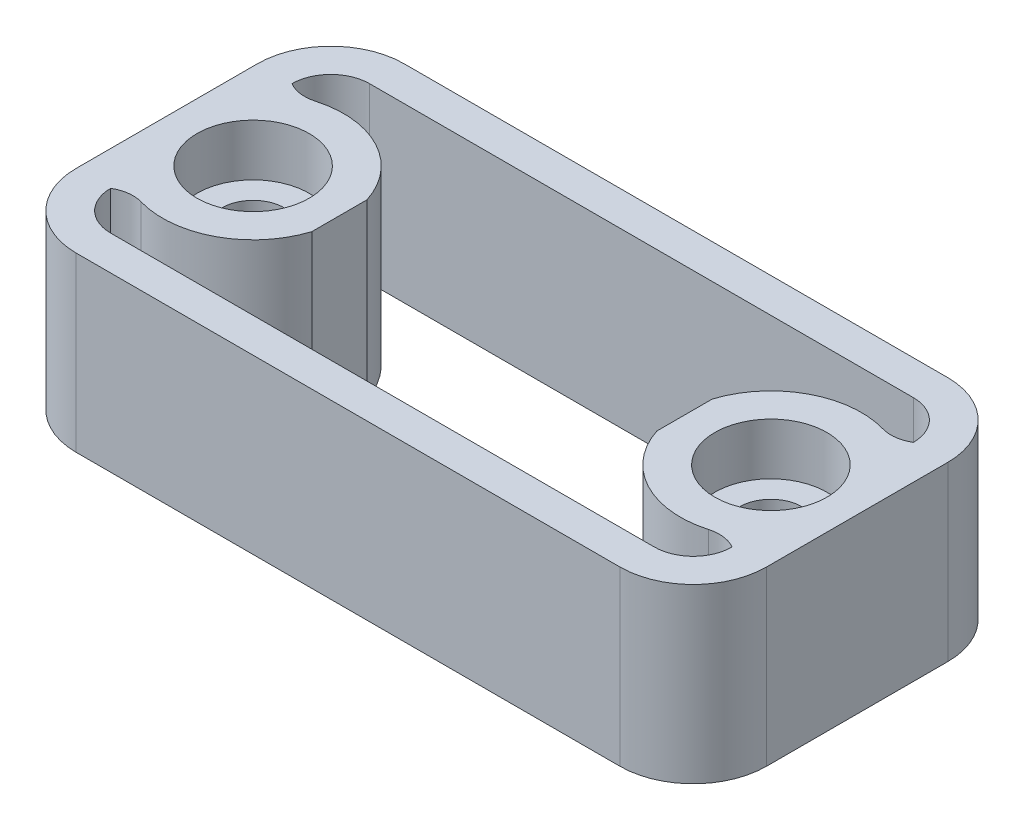
ISO-10303-21;
HEADER;
FILE_DESCRIPTION(('STEP AP214'),'2;1');
FILE_NAME('part.step','',(''),(''),'','','');
FILE_SCHEMA(('AUTOMOTIVE_DESIGN { 1 0 10303 214 1 1 1 1 }'));
ENDSEC;
DATA;
#1=APPLICATION_CONTEXT('core data for automotive mechanical design processes');
#2=APPLICATION_PROTOCOL_DEFINITION('international standard','automotive_design',2000,#1);
#3=PRODUCT_CONTEXT('',#1,'mechanical');
#4=PRODUCT('Part','Part','',(#3));
#5=PRODUCT_RELATED_PRODUCT_CATEGORY('part','',(#4));
#6=PRODUCT_DEFINITION_FORMATION('','',#4);
#7=PRODUCT_DEFINITION_CONTEXT('part definition',#1,'design');
#8=PRODUCT_DEFINITION('design','',#6,#7);
#9=PRODUCT_DEFINITION_SHAPE('','',#8);
#10=(LENGTH_UNIT() NAMED_UNIT(*) SI_UNIT(.MILLI.,.METRE.));
#11=(NAMED_UNIT(*) PLANE_ANGLE_UNIT() SI_UNIT($,.RADIAN.));
#12=(NAMED_UNIT(*) SI_UNIT($,.STERADIAN.) SOLID_ANGLE_UNIT());
#13=UNCERTAINTY_MEASURE_WITH_UNIT(LENGTH_MEASURE(1.E-05),#10,'distance_accuracy_value','');
#14=(GEOMETRIC_REPRESENTATION_CONTEXT(3) GLOBAL_UNCERTAINTY_ASSIGNED_CONTEXT((#13)) GLOBAL_UNIT_ASSIGNED_CONTEXT((#10,
#11,#12)) REPRESENTATION_CONTEXT('',''));
#15=CARTESIAN_POINT('',(0.,0.,0.));
#16=DIRECTION('',(0.,0.,1.));
#17=DIRECTION('',(1.,0.,0.));
#18=AXIS2_PLACEMENT_3D('',#15,#16,#17);
#19=CARTESIAN_POINT('',(-18.,10.,7.50000000000001));
#20=DIRECTION('',(0.,0.,-1.));
#21=DIRECTION('',(-1.,0.,0.));
#22=AXIS2_PLACEMENT_3D('',#19,#20,#21);
#23=PLANE('',#22);
#24=DIRECTION('',(1.,0.,0.));
#25=VECTOR('',#24,1.);
#26=CARTESIAN_POINT('',(-18.,0.,7.50000000000001));
#27=LINE('',#26,#25);
#28=CARTESIAN_POINT('',(-15.75,0.,7.50000000000001));
#29=VERTEX_POINT('',#28);
#30=CARTESIAN_POINT('',(15.75,0.,7.5));
#31=VERTEX_POINT('',#30);
#32=EDGE_CURVE('E258',#29,#31,#27,.T.);
#33=ORIENTED_EDGE('',*,*,#32,.F.);
#34=DIRECTION('',(0.,1.,0.));
#35=VECTOR('',#34,1.);
#36=CARTESIAN_POINT('',(-15.75,0.,7.50000000000001));
#37=LINE('',#36,#35);
#38=CARTESIAN_POINT('',(-15.75,10.,7.50000000000001));
#39=VERTEX_POINT('',#38);
#40=EDGE_CURVE('E209',#29,#39,#37,.T.);
#41=ORIENTED_EDGE('',*,*,#40,.T.);
#42=DIRECTION('',(1.,0.,0.));
#43=VECTOR('',#42,1.);
#44=CARTESIAN_POINT('',(-18.,10.,7.50000000000001));
#45=LINE('',#44,#43);
#46=CARTESIAN_POINT('',(15.75,10.,7.5));
#47=VERTEX_POINT('',#46);
#48=EDGE_CURVE('E259',#39,#47,#45,.T.);
#49=ORIENTED_EDGE('',*,*,#48,.T.);
#50=DIRECTION('',(0.,1.,0.));
#51=VECTOR('',#50,1.);
#52=CARTESIAN_POINT('',(15.75,0.,7.5));
#53=LINE('',#52,#51);
#54=EDGE_CURVE('E215',#31,#47,#53,.T.);
#55=ORIENTED_EDGE('',*,*,#54,.F.);
#56=EDGE_LOOP('',(#33,#41,#49,#55));
#57=FACE_BOUND('',#56,.T.);
#58=ADVANCED_FACE('F33',(#57),#23,.T.);
#59=CARTESIAN_POINT('',(-18.,10.,-7.49999999999999));
#60=DIRECTION('',(0.,0.,1.));
#61=DIRECTION('',(1.,0.,0.));
#62=AXIS2_PLACEMENT_3D('',#59,#60,#61);
#63=PLANE('',#62);
#64=DIRECTION('',(-1.,0.,0.));
#65=VECTOR('',#64,1.);
#66=CARTESIAN_POINT('',(-18.,10.,-7.49999999999999));
#67=LINE('',#66,#65);
#68=CARTESIAN_POINT('',(15.75,10.,-7.49999999999999));
#69=VERTEX_POINT('',#68);
#70=CARTESIAN_POINT('',(-15.75,10.,-7.49999999999999));
#71=VERTEX_POINT('',#70);
#72=EDGE_CURVE('E261',#69,#71,#67,.T.);
#73=ORIENTED_EDGE('',*,*,#72,.T.);
#74=DIRECTION('',(0.,1.,0.));
#75=VECTOR('',#74,1.);
#76=CARTESIAN_POINT('',(-15.75,0.,-7.49999999999999));
#77=LINE('',#76,#75);
#78=CARTESIAN_POINT('',(-15.75,0.,-7.49999999999999));
#79=VERTEX_POINT('',#78);
#80=EDGE_CURVE('E380',#79,#71,#77,.T.);
#81=ORIENTED_EDGE('',*,*,#80,.F.);
#82=DIRECTION('',(-1.,0.,0.));
#83=VECTOR('',#82,1.);
#84=CARTESIAN_POINT('',(-18.,0.,-7.49999999999999));
#85=LINE('',#84,#83);
#86=CARTESIAN_POINT('',(15.75,0.,-7.49999999999999));
#87=VERTEX_POINT('',#86);
#88=EDGE_CURVE('E262',#87,#79,#85,.T.);
#89=ORIENTED_EDGE('',*,*,#88,.F.);
#90=DIRECTION('',(0.,1.,0.));
#91=VECTOR('',#90,1.);
#92=CARTESIAN_POINT('',(15.75,0.,-7.49999999999999));
#93=LINE('',#92,#91);
#94=EDGE_CURVE('E390',#87,#69,#93,.T.);
#95=ORIENTED_EDGE('',*,*,#94,.T.);
#96=EDGE_LOOP('',(#73,#81,#89,#95));
#97=FACE_BOUND('',#96,.T.);
#98=ADVANCED_FACE('F462',(#97),#63,.T.);
#99=CARTESIAN_POINT('',(0.,10.,0.));
#100=DIRECTION('',(0.,1.,0.));
#101=DIRECTION('',(0.,0.,1.));
#102=AXIS2_PLACEMENT_3D('',#99,#100,#101);
#103=PLANE('',#102);
#104=CARTESIAN_POINT('',(-15.,10.,0.));
#105=DIRECTION('',(0.,-1.,0.));
#106=DIRECTION('',(0.,0.,1.));
#107=AXIS2_PLACEMENT_3D('',#104,#105,#106);
#108=CIRCLE('',#107,5.25);
#109=CARTESIAN_POINT('',(-16.4371352785146,10.,-5.04946949602122));
#110=VERTEX_POINT('',#109);
#111=CARTESIAN_POINT('',(-10.,10.,-1.60078105935822));
#112=VERTEX_POINT('',#111);
#113=EDGE_CURVE('E375',#110,#112,#108,.T.);
#114=ORIENTED_EDGE('',*,*,#113,.F.);
#115=CARTESIAN_POINT('',(-16.9846153846154,10.,-6.97307692307692));
#116=DIRECTION('',(0.,1.,0.));
#117=DIRECTION('',(0.,0.,1.));
#118=AXIS2_PLACEMENT_3D('',#115,#116,#117);
#119=CIRCLE('',#118,2.);
#120=CARTESIAN_POINT('',(-18.,10.,-5.24999999999999));
#121=VERTEX_POINT('',#120);
#122=EDGE_CURVE('E355',#110,#121,#119,.F.);
#123=ORIENTED_EDGE('',*,*,#122,.T.);
#124=CARTESIAN_POINT('',(-15.75,10.,-5.24999999999999));
#125=DIRECTION('',(0.,1.,0.));
#126=DIRECTION('',(0.,0.,1.));
#127=AXIS2_PLACEMENT_3D('',#124,#125,#126);
#128=CIRCLE('',#127,2.25);
#129=EDGE_CURVE('E374',#71,#121,#128,.T.);
#130=ORIENTED_EDGE('',*,*,#129,.F.);
#131=ORIENTED_EDGE('',*,*,#72,.F.);
#132=CARTESIAN_POINT('',(15.75,10.,-5.24999999999999));
#133=DIRECTION('',(0.,1.,0.));
#134=DIRECTION('',(0.,0.,1.));
#135=AXIS2_PLACEMENT_3D('',#132,#133,#134);
#136=CIRCLE('',#135,2.25);
#137=CARTESIAN_POINT('',(18.,10.,-5.24999999999999));
#138=VERTEX_POINT('',#137);
#139=EDGE_CURVE('E381',#138,#69,#136,.T.);
#140=ORIENTED_EDGE('',*,*,#139,.F.);
#141=CARTESIAN_POINT('',(16.9846153846154,10.,-6.97307692307692));
#142=DIRECTION('',(0.,1.,0.));
#143=DIRECTION('',(0.,0.,1.));
#144=AXIS2_PLACEMENT_3D('',#141,#142,#143);
#145=CIRCLE('',#144,2.);
#146=CARTESIAN_POINT('',(16.4371352785146,10.,-5.04946949602122));
#147=VERTEX_POINT('',#146);
#148=EDGE_CURVE('E351',#138,#147,#145,.F.);
#149=ORIENTED_EDGE('',*,*,#148,.T.);
#150=CARTESIAN_POINT('',(15.,10.,0.));
#151=DIRECTION('',(0.,-1.,0.));
#152=DIRECTION('',(0.,0.,1.));
#153=AXIS2_PLACEMENT_3D('',#150,#151,#152);
#154=CIRCLE('',#153,5.25);
#155=CARTESIAN_POINT('',(10.,10.,-1.60078105935821));
#156=VERTEX_POINT('',#155);
#157=EDGE_CURVE('E409',#156,#147,#154,.T.);
#158=ORIENTED_EDGE('',*,*,#157,.F.);
#159=DIRECTION('',(0.,0.,1.));
#160=VECTOR('',#159,1.);
#161=CARTESIAN_POINT('',(10.,10.,-7.5));
#162=LINE('',#161,#160);
#163=CARTESIAN_POINT('',(10.,10.,1.60078105935822));
#164=VERTEX_POINT('',#163);
#165=EDGE_CURVE('E255',#156,#164,#162,.T.);
#166=ORIENTED_EDGE('',*,*,#165,.T.);
#167=CARTESIAN_POINT('',(16.4371352785146,10.,5.04946949602122));
#168=VERTEX_POINT('',#167);
#169=EDGE_CURVE('E384',#168,#164,#154,.T.);
#170=ORIENTED_EDGE('',*,*,#169,.F.);
#171=CARTESIAN_POINT('',(16.9846153846154,10.,6.97307692307692));
#172=DIRECTION('',(0.,1.,0.));
#173=DIRECTION('',(0.,0.,1.));
#174=AXIS2_PLACEMENT_3D('',#171,#172,#173);
#175=CIRCLE('',#174,2.);
#176=CARTESIAN_POINT('',(18.,10.,5.25));
#177=VERTEX_POINT('',#176);
#178=EDGE_CURVE('E347',#168,#177,#175,.F.);
#179=ORIENTED_EDGE('',*,*,#178,.T.);
#180=CARTESIAN_POINT('',(15.75,10.,5.25));
#181=DIRECTION('',(0.,1.,0.));
#182=DIRECTION('',(0.,0.,1.));
#183=AXIS2_PLACEMENT_3D('',#180,#181,#182);
#184=CIRCLE('',#183,2.25);
#185=EDGE_CURVE('E405',#47,#177,#184,.T.);
#186=ORIENTED_EDGE('',*,*,#185,.F.);
#187=ORIENTED_EDGE('',*,*,#48,.F.);
#188=CARTESIAN_POINT('',(-15.75,10.,5.25));
#189=DIRECTION('',(0.,1.,0.));
#190=DIRECTION('',(0.,0.,1.));
#191=AXIS2_PLACEMENT_3D('',#188,#189,#190);
#192=CIRCLE('',#191,2.25);
#193=CARTESIAN_POINT('',(-18.,10.,5.25));
#194=VERTEX_POINT('',#193);
#195=EDGE_CURVE('E410',#194,#39,#192,.T.);
#196=ORIENTED_EDGE('',*,*,#195,.F.);
#197=CARTESIAN_POINT('',(-16.9846153846154,10.,6.97307692307692));
#198=DIRECTION('',(0.,1.,0.));
#199=DIRECTION('',(0.,0.,1.));
#200=AXIS2_PLACEMENT_3D('',#197,#198,#199);
#201=CIRCLE('',#200,2.);
#202=CARTESIAN_POINT('',(-16.4371352785146,10.,5.04946949602122));
#203=VERTEX_POINT('',#202);
#204=EDGE_CURVE('E41',#194,#203,#201,.F.);
#205=ORIENTED_EDGE('',*,*,#204,.T.);
#206=CARTESIAN_POINT('',(-10.,10.,1.60078105935822));
#207=VERTEX_POINT('',#206);
#208=EDGE_CURVE('E444',#207,#203,#108,.T.);
#209=ORIENTED_EDGE('',*,*,#208,.F.);
#210=DIRECTION('',(0.,0.,-1.));
#211=VECTOR('',#210,1.);
#212=CARTESIAN_POINT('',(-10.,10.,-7.5));
#213=LINE('',#212,#211);
#214=EDGE_CURVE('E249',#207,#112,#213,.T.);
#215=ORIENTED_EDGE('',*,*,#214,.T.);
#216=EDGE_LOOP('',(#114,#123,#130,#131,#140,#149,#158,#166,#170,#179,#186,#187,#196,#205,#209,#215));
#217=FACE_BOUND('',#216,.T.);
#218=CARTESIAN_POINT('',(-15.,10.,0.));
#219=DIRECTION('',(0.,1.,0.));
#220=DIRECTION('',(0.,0.,1.));
#221=AXIS2_PLACEMENT_3D('',#218,#219,#220);
#222=CIRCLE('',#221,3.25);
#223=CARTESIAN_POINT('',(-15.,10.,3.25));
#224=VERTEX_POINT('',#223);
#225=EDGE_CURVE('E221',#224,#224,#222,.T.);
#226=ORIENTED_EDGE('',*,*,#225,.F.);
#227=EDGE_LOOP('',(#226));
#228=FACE_BOUND('',#227,.T.);
#229=CARTESIAN_POINT('',(15.,10.,0.));
#230=DIRECTION('',(0.,1.,0.));
#231=DIRECTION('',(0.,0.,1.));
#232=AXIS2_PLACEMENT_3D('',#229,#230,#231);
#233=CIRCLE('',#232,3.25);
#234=CARTESIAN_POINT('',(15.,10.,3.25));
#235=VERTEX_POINT('',#234);
#236=EDGE_CURVE('E234',#235,#235,#233,.T.);
#237=ORIENTED_EDGE('',*,*,#236,.F.);
#238=EDGE_LOOP('',(#237));
#239=FACE_BOUND('',#238,.T.);
#240=DIRECTION('',(0.,0.,1.));
#241=VECTOR('',#240,1.);
#242=CARTESIAN_POINT('',(-20.,10.,-9.49999999999999));
#243=LINE('',#242,#241);
#244=CARTESIAN_POINT('',(-20.,10.,-5.24999999999999));
#245=VERTEX_POINT('',#244);
#246=CARTESIAN_POINT('',(-20.,10.,5.25));
#247=VERTEX_POINT('',#246);
#248=EDGE_CURVE('E274',#245,#247,#243,.T.);
#249=ORIENTED_EDGE('',*,*,#248,.T.);
#250=CARTESIAN_POINT('',(-15.75,10.,5.25));
#251=DIRECTION('',(0.,1.,0.));
#252=DIRECTION('',(0.,0.,1.));
#253=AXIS2_PLACEMENT_3D('',#250,#251,#252);
#254=CIRCLE('',#253,4.25);
#255=CARTESIAN_POINT('',(-15.75,10.,9.50000000000001));
#256=VERTEX_POINT('',#255);
#257=EDGE_CURVE('E314',#247,#256,#254,.T.);
#258=ORIENTED_EDGE('',*,*,#257,.T.);
#259=DIRECTION('',(1.,0.,0.));
#260=VECTOR('',#259,1.);
#261=CARTESIAN_POINT('',(-20.,10.,9.50000000000001));
#262=LINE('',#261,#260);
#263=CARTESIAN_POINT('',(15.75,10.,9.50000000000001));
#264=VERTEX_POINT('',#263);
#265=EDGE_CURVE('E277',#256,#264,#262,.T.);
#266=ORIENTED_EDGE('',*,*,#265,.T.);
#267=CARTESIAN_POINT('',(15.75,10.,5.25));
#268=DIRECTION('',(0.,1.,0.));
#269=DIRECTION('',(0.,0.,1.));
#270=AXIS2_PLACEMENT_3D('',#267,#268,#269);
#271=CIRCLE('',#270,4.25);
#272=CARTESIAN_POINT('',(20.,10.,5.25));
#273=VERTEX_POINT('',#272);
#274=EDGE_CURVE('E308',#264,#273,#271,.T.);
#275=ORIENTED_EDGE('',*,*,#274,.T.);
#276=DIRECTION('',(0.,0.,-1.));
#277=VECTOR('',#276,1.);
#278=CARTESIAN_POINT('',(20.,10.,-9.49999999999999));
#279=LINE('',#278,#277);
#280=CARTESIAN_POINT('',(20.,10.,-5.24999999999999));
#281=VERTEX_POINT('',#280);
#282=EDGE_CURVE('E267',#273,#281,#279,.T.);
#283=ORIENTED_EDGE('',*,*,#282,.T.);
#284=CARTESIAN_POINT('',(15.75,10.,-5.24999999999999));
#285=DIRECTION('',(0.,1.,0.));
#286=DIRECTION('',(0.,0.,1.));
#287=AXIS2_PLACEMENT_3D('',#284,#285,#286);
#288=CIRCLE('',#287,4.25);
#289=CARTESIAN_POINT('',(15.75,10.,-9.49999999999999));
#290=VERTEX_POINT('',#289);
#291=EDGE_CURVE('E310',#281,#290,#288,.T.);
#292=ORIENTED_EDGE('',*,*,#291,.T.);
#293=DIRECTION('',(-1.,0.,0.));
#294=VECTOR('',#293,1.);
#295=CARTESIAN_POINT('',(-20.,10.,-9.49999999999999));
#296=LINE('',#295,#294);
#297=CARTESIAN_POINT('',(-15.75,10.,-9.49999999999999));
#298=VERTEX_POINT('',#297);
#299=EDGE_CURVE('E270',#290,#298,#296,.T.);
#300=ORIENTED_EDGE('',*,*,#299,.T.);
#301=CARTESIAN_POINT('',(-15.75,10.,-5.24999999999999));
#302=DIRECTION('',(0.,1.,0.));
#303=DIRECTION('',(0.,0.,1.));
#304=AXIS2_PLACEMENT_3D('',#301,#302,#303);
#305=CIRCLE('',#304,4.25);
#306=EDGE_CURVE('E312',#298,#245,#305,.T.);
#307=ORIENTED_EDGE('',*,*,#306,.T.);
#308=EDGE_LOOP('',(#249,#258,#266,#275,#283,#292,#300,#307));
#309=FACE_BOUND('',#308,.T.);
#310=ADVANCED_FACE('F372',(#217,#228,#239,#309),#103,.T.);
#311=CARTESIAN_POINT('',(0.,0.,0.));
#312=DIRECTION('',(0.,1.,0.));
#313=DIRECTION('',(0.,0.,1.));
#314=AXIS2_PLACEMENT_3D('',#311,#312,#313);
#315=PLANE('',#314);
#316=CARTESIAN_POINT('',(-15.75,0.,-5.24999999999999));
#317=DIRECTION('',(0.,1.,0.));
#318=DIRECTION('',(0.,0.,1.));
#319=AXIS2_PLACEMENT_3D('',#316,#317,#318);
#320=CIRCLE('',#319,2.25);
#321=CARTESIAN_POINT('',(-18.,0.,-5.24999999999999));
#322=VERTEX_POINT('',#321);
#323=EDGE_CURVE('E213',#79,#322,#320,.T.);
#324=ORIENTED_EDGE('',*,*,#323,.T.);
#325=CARTESIAN_POINT('',(-16.9846153846154,0.,-6.97307692307692));
#326=DIRECTION('',(0.,1.,0.));
#327=DIRECTION('',(0.,0.,1.));
#328=AXIS2_PLACEMENT_3D('',#325,#326,#327);
#329=CIRCLE('',#328,2.);
#330=CARTESIAN_POINT('',(-16.4371352785146,0.,-5.04946949602122));
#331=VERTEX_POINT('',#330);
#332=EDGE_CURVE('E357',#322,#331,#329,.T.);
#333=ORIENTED_EDGE('',*,*,#332,.T.);
#334=CARTESIAN_POINT('',(-15.,0.,0.));
#335=DIRECTION('',(0.,-1.,0.));
#336=DIRECTION('',(0.,0.,1.));
#337=AXIS2_PLACEMENT_3D('',#334,#335,#336);
#338=CIRCLE('',#337,5.25);
#339=CARTESIAN_POINT('',(-10.,0.,-1.60078105935822));
#340=VERTEX_POINT('',#339);
#341=EDGE_CURVE('E211',#331,#340,#338,.T.);
#342=ORIENTED_EDGE('',*,*,#341,.T.);
#343=DIRECTION('',(0.,0.,-1.));
#344=VECTOR('',#343,1.);
#345=CARTESIAN_POINT('',(-10.,0.,-7.5));
#346=LINE('',#345,#344);
#347=CARTESIAN_POINT('',(-10.,0.,1.60078105935822));
#348=VERTEX_POINT('',#347);
#349=EDGE_CURVE('E246',#348,#340,#346,.T.);
#350=ORIENTED_EDGE('',*,*,#349,.F.);
#351=CARTESIAN_POINT('',(-16.4371352785146,0.,5.04946949602122));
#352=VERTEX_POINT('',#351);
#353=EDGE_CURVE('E199',#348,#352,#338,.T.);
#354=ORIENTED_EDGE('',*,*,#353,.T.);
#355=CARTESIAN_POINT('',(-16.9846153846154,0.,6.97307692307692));
#356=DIRECTION('',(0.,1.,0.));
#357=DIRECTION('',(0.,0.,1.));
#358=AXIS2_PLACEMENT_3D('',#355,#356,#357);
#359=CIRCLE('',#358,2.);
#360=CARTESIAN_POINT('',(-18.,0.,5.25));
#361=VERTEX_POINT('',#360);
#362=EDGE_CURVE('E11',#352,#361,#359,.T.);
#363=ORIENTED_EDGE('',*,*,#362,.T.);
#364=CARTESIAN_POINT('',(-15.75,0.,5.25));
#365=DIRECTION('',(0.,1.,0.));
#366=DIRECTION('',(0.,0.,1.));
#367=AXIS2_PLACEMENT_3D('',#364,#365,#366);
#368=CIRCLE('',#367,2.25);
#369=EDGE_CURVE('E197',#361,#29,#368,.T.);
#370=ORIENTED_EDGE('',*,*,#369,.T.);
#371=ORIENTED_EDGE('',*,*,#32,.T.);
#372=CARTESIAN_POINT('',(15.75,0.,5.25));
#373=DIRECTION('',(0.,1.,0.));
#374=DIRECTION('',(0.,0.,1.));
#375=AXIS2_PLACEMENT_3D('',#372,#373,#374);
#376=CIRCLE('',#375,2.25);
#377=CARTESIAN_POINT('',(18.,0.,5.25));
#378=VERTEX_POINT('',#377);
#379=EDGE_CURVE('E210',#31,#378,#376,.T.);
#380=ORIENTED_EDGE('',*,*,#379,.T.);
#381=CARTESIAN_POINT('',(16.9846153846154,0.,6.97307692307692));
#382=DIRECTION('',(0.,1.,0.));
#383=DIRECTION('',(0.,0.,1.));
#384=AXIS2_PLACEMENT_3D('',#381,#382,#383);
#385=CIRCLE('',#384,2.);
#386=CARTESIAN_POINT('',(16.4371352785146,0.,5.04946949602122));
#387=VERTEX_POINT('',#386);
#388=EDGE_CURVE('E349',#378,#387,#385,.T.);
#389=ORIENTED_EDGE('',*,*,#388,.T.);
#390=CARTESIAN_POINT('',(15.,0.,0.));
#391=DIRECTION('',(0.,-1.,0.));
#392=DIRECTION('',(0.,0.,1.));
#393=AXIS2_PLACEMENT_3D('',#390,#391,#392);
#394=CIRCLE('',#393,5.25);
#395=CARTESIAN_POINT('',(10.,0.,1.60078105935822));
#396=VERTEX_POINT('',#395);
#397=EDGE_CURVE('E440',#387,#396,#394,.T.);
#398=ORIENTED_EDGE('',*,*,#397,.T.);
#399=DIRECTION('',(0.,0.,1.));
#400=VECTOR('',#399,1.);
#401=CARTESIAN_POINT('',(10.,0.,-7.5));
#402=LINE('',#401,#400);
#403=CARTESIAN_POINT('',(10.,0.,-1.60078105935821));
#404=VERTEX_POINT('',#403);
#405=EDGE_CURVE('E252',#404,#396,#402,.T.);
#406=ORIENTED_EDGE('',*,*,#405,.F.);
#407=CARTESIAN_POINT('',(16.4371352785146,0.,-5.04946949602122));
#408=VERTEX_POINT('',#407);
#409=EDGE_CURVE('E436',#404,#408,#394,.T.);
#410=ORIENTED_EDGE('',*,*,#409,.T.);
#411=CARTESIAN_POINT('',(16.9846153846154,0.,-6.97307692307692));
#412=DIRECTION('',(0.,1.,0.));
#413=DIRECTION('',(0.,0.,1.));
#414=AXIS2_PLACEMENT_3D('',#411,#412,#413);
#415=CIRCLE('',#414,2.);
#416=CARTESIAN_POINT('',(18.,0.,-5.24999999999999));
#417=VERTEX_POINT('',#416);
#418=EDGE_CURVE('E353',#408,#417,#415,.T.);
#419=ORIENTED_EDGE('',*,*,#418,.T.);
#420=CARTESIAN_POINT('',(15.75,0.,-5.24999999999999));
#421=DIRECTION('',(0.,1.,0.));
#422=DIRECTION('',(0.,0.,1.));
#423=AXIS2_PLACEMENT_3D('',#420,#421,#422);
#424=CIRCLE('',#423,2.25);
#425=EDGE_CURVE('E217',#417,#87,#424,.T.);
#426=ORIENTED_EDGE('',*,*,#425,.T.);
#427=ORIENTED_EDGE('',*,*,#88,.T.);
#428=EDGE_LOOP('',(#324,#333,#342,#350,#354,#363,#370,#371,#380,#389,#398,#406,#410,#419,#426,#427));
#429=FACE_BOUND('',#428,.T.);
#430=CARTESIAN_POINT('',(-15.,0.,0.));
#431=DIRECTION('',(0.,1.,0.));
#432=DIRECTION('',(0.,0.,1.));
#433=AXIS2_PLACEMENT_3D('',#430,#431,#432);
#434=CIRCLE('',#433,1.8);
#435=CARTESIAN_POINT('',(-15.,0.,1.8));
#436=VERTEX_POINT('',#435);
#437=EDGE_CURVE('E231',#436,#436,#434,.T.);
#438=ORIENTED_EDGE('',*,*,#437,.T.);
#439=EDGE_LOOP('',(#438));
#440=FACE_BOUND('',#439,.T.);
#441=CARTESIAN_POINT('',(15.,0.,0.));
#442=DIRECTION('',(0.,1.,0.));
#443=DIRECTION('',(0.,0.,1.));
#444=AXIS2_PLACEMENT_3D('',#441,#442,#443);
#445=CIRCLE('',#444,1.8);
#446=CARTESIAN_POINT('',(15.,0.,1.8));
#447=VERTEX_POINT('',#446);
#448=EDGE_CURVE('E243',#447,#447,#445,.T.);
#449=ORIENTED_EDGE('',*,*,#448,.T.);
#450=EDGE_LOOP('',(#449));
#451=FACE_BOUND('',#450,.T.);
#452=DIRECTION('',(1.,0.,0.));
#453=VECTOR('',#452,1.);
#454=CARTESIAN_POINT('',(-20.,0.,9.50000000000001));
#455=LINE('',#454,#453);
#456=CARTESIAN_POINT('',(-15.75,0.,9.50000000000001));
#457=VERTEX_POINT('',#456);
#458=CARTESIAN_POINT('',(15.75,0.,9.50000000000001));
#459=VERTEX_POINT('',#458);
#460=EDGE_CURVE('E271',#457,#459,#455,.T.);
#461=ORIENTED_EDGE('',*,*,#460,.F.);
#462=CARTESIAN_POINT('',(-15.75,0.,5.25));
#463=DIRECTION('',(0.,1.,0.));
#464=DIRECTION('',(0.,0.,1.));
#465=AXIS2_PLACEMENT_3D('',#462,#463,#464);
#466=CIRCLE('',#465,4.25);
#467=CARTESIAN_POINT('',(-20.,0.,5.25));
#468=VERTEX_POINT('',#467);
#469=EDGE_CURVE('E301',#457,#468,#466,.F.);
#470=ORIENTED_EDGE('',*,*,#469,.T.);
#471=DIRECTION('',(0.,0.,1.));
#472=VECTOR('',#471,1.);
#473=CARTESIAN_POINT('',(-20.,0.,-9.49999999999999));
#474=LINE('',#473,#472);
#475=CARTESIAN_POINT('',(-20.,0.,-5.24999999999999));
#476=VERTEX_POINT('',#475);
#477=EDGE_CURVE('E286',#476,#468,#474,.T.);
#478=ORIENTED_EDGE('',*,*,#477,.F.);
#479=CARTESIAN_POINT('',(-15.75,0.,-5.24999999999999));
#480=DIRECTION('',(0.,1.,0.));
#481=DIRECTION('',(0.,0.,1.));
#482=AXIS2_PLACEMENT_3D('',#479,#480,#481);
#483=CIRCLE('',#482,4.25);
#484=CARTESIAN_POINT('',(-15.75,0.,-9.49999999999999));
#485=VERTEX_POINT('',#484);
#486=EDGE_CURVE('E299',#476,#485,#483,.F.);
#487=ORIENTED_EDGE('',*,*,#486,.T.);
#488=DIRECTION('',(-1.,0.,0.));
#489=VECTOR('',#488,1.);
#490=CARTESIAN_POINT('',(-20.,0.,-9.49999999999999));
#491=LINE('',#490,#489);
#492=CARTESIAN_POINT('',(15.75,0.,-9.49999999999999));
#493=VERTEX_POINT('',#492);
#494=EDGE_CURVE('E283',#493,#485,#491,.T.);
#495=ORIENTED_EDGE('',*,*,#494,.F.);
#496=CARTESIAN_POINT('',(15.75,0.,-5.24999999999999));
#497=DIRECTION('',(0.,1.,0.));
#498=DIRECTION('',(0.,0.,1.));
#499=AXIS2_PLACEMENT_3D('',#496,#497,#498);
#500=CIRCLE('',#499,4.25);
#501=CARTESIAN_POINT('',(20.,0.,-5.24999999999999));
#502=VERTEX_POINT('',#501);
#503=EDGE_CURVE('E297',#493,#502,#500,.F.);
#504=ORIENTED_EDGE('',*,*,#503,.T.);
#505=DIRECTION('',(0.,0.,-1.));
#506=VECTOR('',#505,1.);
#507=CARTESIAN_POINT('',(20.,0.,-9.49999999999999));
#508=LINE('',#507,#506);
#509=CARTESIAN_POINT('',(20.,0.,5.25));
#510=VERTEX_POINT('',#509);
#511=EDGE_CURVE('E264',#510,#502,#508,.T.);
#512=ORIENTED_EDGE('',*,*,#511,.F.);
#513=CARTESIAN_POINT('',(15.75,0.,5.25));
#514=DIRECTION('',(0.,1.,0.));
#515=DIRECTION('',(0.,0.,1.));
#516=AXIS2_PLACEMENT_3D('',#513,#514,#515);
#517=CIRCLE('',#516,4.25);
#518=EDGE_CURVE('E295',#510,#459,#517,.F.);
#519=ORIENTED_EDGE('',*,*,#518,.T.);
#520=EDGE_LOOP('',(#461,#470,#478,#487,#495,#504,#512,#519));
#521=FACE_BOUND('',#520,.T.);
#522=ADVANCED_FACE('F195',(#429,#440,#451,#521),#315,.F.);
#523=CARTESIAN_POINT('',(20.,10.,-9.49999999999999));
#524=DIRECTION('',(-1.,0.,0.));
#525=DIRECTION('',(0.,0.,1.));
#526=AXIS2_PLACEMENT_3D('',#523,#524,#525);
#527=PLANE('',#526);
#528=ORIENTED_EDGE('',*,*,#511,.T.);
#529=DIRECTION('',(0.,-1.,0.));
#530=VECTOR('',#529,1.);
#531=CARTESIAN_POINT('',(20.,10.,-5.24999999999999));
#532=LINE('',#531,#530);
#533=EDGE_CURVE('E324',#502,#281,#532,.F.);
#534=ORIENTED_EDGE('',*,*,#533,.T.);
#535=ORIENTED_EDGE('',*,*,#282,.F.);
#536=DIRECTION('',(0.,-1.,0.));
#537=VECTOR('',#536,1.);
#538=CARTESIAN_POINT('',(20.,10.,5.25));
#539=LINE('',#538,#537);
#540=EDGE_CURVE('E321',#273,#510,#539,.T.);
#541=ORIENTED_EDGE('',*,*,#540,.T.);
#542=EDGE_LOOP('',(#528,#534,#535,#541));
#543=FACE_BOUND('',#542,.T.);
#544=ADVANCED_FACE('F475',(#543),#527,.F.);
#545=CARTESIAN_POINT('',(-20.,10.,-9.49999999999999));
#546=DIRECTION('',(0.,0.,1.));
#547=DIRECTION('',(1.,0.,0.));
#548=AXIS2_PLACEMENT_3D('',#545,#546,#547);
#549=PLANE('',#548);
#550=ORIENTED_EDGE('',*,*,#494,.T.);
#551=DIRECTION('',(0.,-1.,0.));
#552=VECTOR('',#551,1.);
#553=CARTESIAN_POINT('',(-15.75,10.,-9.49999999999999));
#554=LINE('',#553,#552);
#555=EDGE_CURVE('E319',#485,#298,#554,.F.);
#556=ORIENTED_EDGE('',*,*,#555,.T.);
#557=ORIENTED_EDGE('',*,*,#299,.F.);
#558=DIRECTION('',(0.,-1.,0.));
#559=VECTOR('',#558,1.);
#560=CARTESIAN_POINT('',(15.75,10.,-9.49999999999999));
#561=LINE('',#560,#559);
#562=EDGE_CURVE('E316',#290,#493,#561,.T.);
#563=ORIENTED_EDGE('',*,*,#562,.T.);
#564=EDGE_LOOP('',(#550,#556,#557,#563));
#565=FACE_BOUND('',#564,.T.);
#566=ADVANCED_FACE('F484',(#565),#549,.F.);
#567=CARTESIAN_POINT('',(-20.,10.,-9.49999999999999));
#568=DIRECTION('',(1.,0.,0.));
#569=DIRECTION('',(0.,0.,-1.));
#570=AXIS2_PLACEMENT_3D('',#567,#568,#569);
#571=PLANE('',#570);
#572=ORIENTED_EDGE('',*,*,#477,.T.);
#573=DIRECTION('',(0.,-1.,0.));
#574=VECTOR('',#573,1.);
#575=CARTESIAN_POINT('',(-20.,10.,5.25));
#576=LINE('',#575,#574);
#577=EDGE_CURVE('E306',#468,#247,#576,.F.);
#578=ORIENTED_EDGE('',*,*,#577,.T.);
#579=ORIENTED_EDGE('',*,*,#248,.F.);
#580=DIRECTION('',(0.,-1.,0.));
#581=VECTOR('',#580,1.);
#582=CARTESIAN_POINT('',(-20.,10.,-5.24999999999999));
#583=LINE('',#582,#581);
#584=EDGE_CURVE('E303',#245,#476,#583,.T.);
#585=ORIENTED_EDGE('',*,*,#584,.T.);
#586=EDGE_LOOP('',(#572,#578,#579,#585));
#587=FACE_BOUND('',#586,.T.);
#588=ADVANCED_FACE('F480',(#587),#571,.F.);
#589=CARTESIAN_POINT('',(-20.,10.,9.50000000000001));
#590=DIRECTION('',(0.,0.,-1.));
#591=DIRECTION('',(-1.,0.,0.));
#592=AXIS2_PLACEMENT_3D('',#589,#590,#591);
#593=PLANE('',#592);
#594=ORIENTED_EDGE('',*,*,#265,.F.);
#595=DIRECTION('',(0.,-1.,0.));
#596=VECTOR('',#595,1.);
#597=CARTESIAN_POINT('',(-15.75,10.,9.50000000000001));
#598=LINE('',#597,#596);
#599=EDGE_CURVE('E292',#256,#457,#598,.T.);
#600=ORIENTED_EDGE('',*,*,#599,.T.);
#601=ORIENTED_EDGE('',*,*,#460,.T.);
#602=DIRECTION('',(0.,-1.,0.));
#603=VECTOR('',#602,1.);
#604=CARTESIAN_POINT('',(15.75,10.,9.50000000000001));
#605=LINE('',#604,#603);
#606=EDGE_CURVE('E280',#459,#264,#605,.F.);
#607=ORIENTED_EDGE('',*,*,#606,.T.);
#608=EDGE_LOOP('',(#594,#600,#601,#607));
#609=FACE_BOUND('',#608,.T.);
#610=ADVANCED_FACE('F476',(#609),#593,.F.);
#611=CARTESIAN_POINT('',(-15.75,10.,5.25));
#612=DIRECTION('',(0.,-1.,0.));
#613=DIRECTION('',(0.,0.,-1.));
#614=AXIS2_PLACEMENT_3D('',#611,#612,#613);
#615=CYLINDRICAL_SURFACE('',#614,4.25);
#616=ORIENTED_EDGE('',*,*,#257,.F.);
#617=ORIENTED_EDGE('',*,*,#577,.F.);
#618=ORIENTED_EDGE('',*,*,#469,.F.);
#619=ORIENTED_EDGE('',*,*,#599,.F.);
#620=EDGE_LOOP('',(#616,#617,#618,#619));
#621=FACE_BOUND('',#620,.T.);
#622=ADVANCED_FACE('F479',(#621),#615,.T.);
#623=CARTESIAN_POINT('',(-15.75,10.,-5.24999999999999));
#624=DIRECTION('',(0.,-1.,0.));
#625=DIRECTION('',(0.,0.,-1.));
#626=AXIS2_PLACEMENT_3D('',#623,#624,#625);
#627=CYLINDRICAL_SURFACE('',#626,4.25);
#628=ORIENTED_EDGE('',*,*,#306,.F.);
#629=ORIENTED_EDGE('',*,*,#555,.F.);
#630=ORIENTED_EDGE('',*,*,#486,.F.);
#631=ORIENTED_EDGE('',*,*,#584,.F.);
#632=EDGE_LOOP('',(#628,#629,#630,#631));
#633=FACE_BOUND('',#632,.T.);
#634=ADVANCED_FACE('F494',(#633),#627,.T.);
#635=CARTESIAN_POINT('',(15.75,10.,-5.24999999999999));
#636=DIRECTION('',(0.,-1.,0.));
#637=DIRECTION('',(0.,0.,-1.));
#638=AXIS2_PLACEMENT_3D('',#635,#636,#637);
#639=CYLINDRICAL_SURFACE('',#638,4.25);
#640=ORIENTED_EDGE('',*,*,#291,.F.);
#641=ORIENTED_EDGE('',*,*,#533,.F.);
#642=ORIENTED_EDGE('',*,*,#503,.F.);
#643=ORIENTED_EDGE('',*,*,#562,.F.);
#644=EDGE_LOOP('',(#640,#641,#642,#643));
#645=FACE_BOUND('',#644,.T.);
#646=ADVANCED_FACE('F498',(#645),#639,.T.);
#647=CARTESIAN_POINT('',(15.75,10.,5.25));
#648=DIRECTION('',(0.,-1.,0.));
#649=DIRECTION('',(0.,0.,-1.));
#650=AXIS2_PLACEMENT_3D('',#647,#648,#649);
#651=CYLINDRICAL_SURFACE('',#650,4.25);
#652=ORIENTED_EDGE('',*,*,#274,.F.);
#653=ORIENTED_EDGE('',*,*,#606,.F.);
#654=ORIENTED_EDGE('',*,*,#518,.F.);
#655=ORIENTED_EDGE('',*,*,#540,.F.);
#656=EDGE_LOOP('',(#652,#653,#654,#655));
#657=FACE_BOUND('',#656,.T.);
#658=ADVANCED_FACE('F459',(#657),#651,.T.);
#659=CARTESIAN_POINT('',(10.,27.,-7.5));
#660=DIRECTION('',(1.,0.,0.));
#661=DIRECTION('',(0.,0.,-1.));
#662=AXIS2_PLACEMENT_3D('',#659,#660,#661);
#663=PLANE('',#662);
#664=ORIENTED_EDGE('',*,*,#165,.F.);
#665=DIRECTION('',(0.,1.,0.));
#666=VECTOR('',#665,1.);
#667=CARTESIAN_POINT('',(10.,0.,-1.60078105935822));
#668=LINE('',#667,#666);
#669=EDGE_CURVE('E335',#156,#404,#668,.F.);
#670=ORIENTED_EDGE('',*,*,#669,.T.);
#671=ORIENTED_EDGE('',*,*,#405,.T.);
#672=DIRECTION('',(0.,1.,0.));
#673=VECTOR('',#672,1.);
#674=CARTESIAN_POINT('',(10.,0.,1.60078105935822));
#675=LINE('',#674,#673);
#676=EDGE_CURVE('E332',#396,#164,#675,.T.);
#677=ORIENTED_EDGE('',*,*,#676,.T.);
#678=EDGE_LOOP('',(#664,#670,#671,#677));
#679=FACE_BOUND('',#678,.T.);
#680=ADVANCED_FACE('F422',(#679),#663,.F.);
#681=CARTESIAN_POINT('',(-10.,27.,-7.5));
#682=DIRECTION('',(-1.,0.,0.));
#683=DIRECTION('',(0.,0.,1.));
#684=AXIS2_PLACEMENT_3D('',#681,#682,#683);
#685=PLANE('',#684);
#686=ORIENTED_EDGE('',*,*,#214,.F.);
#687=DIRECTION('',(0.,1.,0.));
#688=VECTOR('',#687,1.);
#689=CARTESIAN_POINT('',(-10.,0.,1.60078105935822));
#690=LINE('',#689,#688);
#691=EDGE_CURVE('E329',#207,#348,#690,.F.);
#692=ORIENTED_EDGE('',*,*,#691,.T.);
#693=ORIENTED_EDGE('',*,*,#349,.T.);
#694=DIRECTION('',(0.,1.,0.));
#695=VECTOR('',#694,1.);
#696=CARTESIAN_POINT('',(-10.,0.,-1.60078105935822));
#697=LINE('',#696,#695);
#698=EDGE_CURVE('E326',#340,#112,#697,.T.);
#699=ORIENTED_EDGE('',*,*,#698,.T.);
#700=EDGE_LOOP('',(#686,#692,#693,#699));
#701=FACE_BOUND('',#700,.T.);
#702=ADVANCED_FACE('F448',(#701),#685,.F.);
#703=CARTESIAN_POINT('',(15.,10.,0.));
#704=DIRECTION('',(0.,1.,0.));
#705=DIRECTION('',(0.,0.,1.));
#706=AXIS2_PLACEMENT_3D('',#703,#704,#705);
#707=CYLINDRICAL_SURFACE('',#706,1.8);
#708=ORIENTED_EDGE('',*,*,#448,.F.);
#709=EDGE_LOOP('',(#708));
#710=FACE_BOUND('',#709,.T.);
#711=CARTESIAN_POINT('',(15.,7.,0.));
#712=DIRECTION('',(0.,1.,0.));
#713=DIRECTION('',(0.,0.,1.));
#714=AXIS2_PLACEMENT_3D('',#711,#712,#713);
#715=CIRCLE('',#714,1.8);
#716=CARTESIAN_POINT('',(15.,7.,1.8));
#717=VERTEX_POINT('',#716);
#718=EDGE_CURVE('E240',#717,#717,#715,.T.);
#719=ORIENTED_EDGE('',*,*,#718,.T.);
#720=EDGE_LOOP('',(#719));
#721=FACE_BOUND('',#720,.T.);
#722=ADVANCED_FACE('F450',(#710,#721),#707,.F.);
#723=CARTESIAN_POINT('',(16.8,7.,0.));
#724=DIRECTION('',(0.,-1.,0.));
#725=DIRECTION('',(0.,0.,-1.));
#726=AXIS2_PLACEMENT_3D('',#723,#724,#725);
#727=PLANE('',#726);
#728=ORIENTED_EDGE('',*,*,#718,.F.);
#729=EDGE_LOOP('',(#728));
#730=FACE_BOUND('',#729,.T.);
#731=CARTESIAN_POINT('',(15.,7.,0.));
#732=DIRECTION('',(0.,1.,0.));
#733=DIRECTION('',(0.,0.,1.));
#734=AXIS2_PLACEMENT_3D('',#731,#732,#733);
#735=CIRCLE('',#734,3.25);
#736=CARTESIAN_POINT('',(15.,7.,3.25));
#737=VERTEX_POINT('',#736);
#738=EDGE_CURVE('E237',#737,#737,#735,.T.);
#739=ORIENTED_EDGE('',*,*,#738,.T.);
#740=EDGE_LOOP('',(#739));
#741=FACE_BOUND('',#740,.T.);
#742=ADVANCED_FACE('F456',(#730,#741),#727,.F.);
#743=CARTESIAN_POINT('',(15.,10.,0.));
#744=DIRECTION('',(0.,1.,0.));
#745=DIRECTION('',(0.,0.,1.));
#746=AXIS2_PLACEMENT_3D('',#743,#744,#745);
#747=CYLINDRICAL_SURFACE('',#746,3.25);
#748=ORIENTED_EDGE('',*,*,#738,.F.);
#749=EDGE_LOOP('',(#748));
#750=FACE_BOUND('',#749,.T.);
#751=ORIENTED_EDGE('',*,*,#236,.T.);
#752=EDGE_LOOP('',(#751));
#753=FACE_BOUND('',#752,.T.);
#754=ADVANCED_FACE('F661',(#750,#753),#747,.F.);
#755=CARTESIAN_POINT('',(-15.,10.,0.));
#756=DIRECTION('',(0.,1.,0.));
#757=DIRECTION('',(0.,0.,1.));
#758=AXIS2_PLACEMENT_3D('',#755,#756,#757);
#759=CYLINDRICAL_SURFACE('',#758,1.8);
#760=ORIENTED_EDGE('',*,*,#437,.F.);
#761=EDGE_LOOP('',(#760));
#762=FACE_BOUND('',#761,.T.);
#763=CARTESIAN_POINT('',(-15.,7.,0.));
#764=DIRECTION('',(0.,1.,0.));
#765=DIRECTION('',(0.,0.,1.));
#766=AXIS2_PLACEMENT_3D('',#763,#764,#765);
#767=CIRCLE('',#766,1.8);
#768=CARTESIAN_POINT('',(-15.,7.,1.8));
#769=VERTEX_POINT('',#768);
#770=EDGE_CURVE('E228',#769,#769,#767,.T.);
#771=ORIENTED_EDGE('',*,*,#770,.T.);
#772=EDGE_LOOP('',(#771));
#773=FACE_BOUND('',#772,.T.);
#774=ADVANCED_FACE('F651',(#762,#773),#759,.F.);
#775=CARTESIAN_POINT('',(-13.2,7.,0.));
#776=DIRECTION('',(0.,-1.,0.));
#777=DIRECTION('',(0.,0.,-1.));
#778=AXIS2_PLACEMENT_3D('',#775,#776,#777);
#779=PLANE('',#778);
#780=ORIENTED_EDGE('',*,*,#770,.F.);
#781=EDGE_LOOP('',(#780));
#782=FACE_BOUND('',#781,.T.);
#783=CARTESIAN_POINT('',(-15.,7.,0.));
#784=DIRECTION('',(0.,1.,0.));
#785=DIRECTION('',(0.,0.,1.));
#786=AXIS2_PLACEMENT_3D('',#783,#784,#785);
#787=CIRCLE('',#786,3.25);
#788=CARTESIAN_POINT('',(-15.,7.,3.25));
#789=VERTEX_POINT('',#788);
#790=EDGE_CURVE('E224',#789,#789,#787,.T.);
#791=ORIENTED_EDGE('',*,*,#790,.T.);
#792=EDGE_LOOP('',(#791));
#793=FACE_BOUND('',#792,.T.);
#794=ADVANCED_FACE('F641',(#782,#793),#779,.F.);
#795=CARTESIAN_POINT('',(-15.,10.,0.));
#796=DIRECTION('',(0.,1.,0.));
#797=DIRECTION('',(0.,0.,1.));
#798=AXIS2_PLACEMENT_3D('',#795,#796,#797);
#799=CYLINDRICAL_SURFACE('',#798,3.25);
#800=ORIENTED_EDGE('',*,*,#790,.F.);
#801=EDGE_LOOP('',(#800));
#802=FACE_BOUND('',#801,.T.);
#803=ORIENTED_EDGE('',*,*,#225,.T.);
#804=EDGE_LOOP('',(#803));
#805=FACE_BOUND('',#804,.T.);
#806=ADVANCED_FACE('F596',(#802,#805),#799,.F.);
#807=CARTESIAN_POINT('',(-15.,0.,0.));
#808=DIRECTION('',(0.,1.,0.));
#809=DIRECTION('',(0.,0.,1.));
#810=AXIS2_PLACEMENT_3D('',#807,#808,#809);
#811=CYLINDRICAL_SURFACE('',#810,5.25);
#812=ORIENTED_EDGE('',*,*,#208,.T.);
#813=DIRECTION('',(0.,1.,0.));
#814=VECTOR('',#813,1.);
#815=CARTESIAN_POINT('',(-16.4371352785146,0.,5.04946949602122));
#816=LINE('',#815,#814);
#817=EDGE_CURVE('E48',#203,#352,#816,.F.);
#818=ORIENTED_EDGE('',*,*,#817,.T.);
#819=ORIENTED_EDGE('',*,*,#353,.F.);
#820=ORIENTED_EDGE('',*,*,#691,.F.);
#821=EDGE_LOOP('',(#812,#818,#819,#820));
#822=FACE_BOUND('',#821,.T.);
#823=ADVANCED_FACE('F445',(#822),#811,.T.);
#824=CARTESIAN_POINT('',(-15.75,0.,5.25));
#825=DIRECTION('',(0.,1.,0.));
#826=DIRECTION('',(0.,0.,1.));
#827=AXIS2_PLACEMENT_3D('',#824,#825,#826);
#828=CYLINDRICAL_SURFACE('',#827,2.25);
#829=ORIENTED_EDGE('',*,*,#195,.T.);
#830=ORIENTED_EDGE('',*,*,#40,.F.);
#831=ORIENTED_EDGE('',*,*,#369,.F.);
#832=DIRECTION('',(0.,1.,0.));
#833=VECTOR('',#832,1.);
#834=CARTESIAN_POINT('',(-18.,0.,5.25));
#835=LINE('',#834,#833);
#836=EDGE_CURVE('E207',#361,#194,#835,.T.);
#837=ORIENTED_EDGE('',*,*,#836,.T.);
#838=EDGE_LOOP('',(#829,#830,#831,#837));
#839=FACE_BOUND('',#838,.T.);
#840=ADVANCED_FACE('F206',(#839),#828,.F.);
#841=ORIENTED_EDGE('',*,*,#341,.F.);
#842=DIRECTION('',(0.,1.,0.));
#843=VECTOR('',#842,1.);
#844=CARTESIAN_POINT('',(-16.4371352785146,0.,-5.04946949602122));
#845=LINE('',#844,#843);
#846=EDGE_CURVE('E343',#331,#110,#845,.T.);
#847=ORIENTED_EDGE('',*,*,#846,.T.);
#848=ORIENTED_EDGE('',*,*,#113,.T.);
#849=ORIENTED_EDGE('',*,*,#698,.F.);
#850=EDGE_LOOP('',(#841,#847,#848,#849));
#851=FACE_BOUND('',#850,.T.);
#852=ADVANCED_FACE('F366',(#851),#811,.T.);
#853=CARTESIAN_POINT('',(-15.75,0.,-5.24999999999999));
#854=DIRECTION('',(0.,1.,0.));
#855=DIRECTION('',(0.,0.,1.));
#856=AXIS2_PLACEMENT_3D('',#853,#854,#855);
#857=CYLINDRICAL_SURFACE('',#856,2.25);
#858=ORIENTED_EDGE('',*,*,#129,.T.);
#859=DIRECTION('',(0.,1.,0.));
#860=VECTOR('',#859,1.);
#861=CARTESIAN_POINT('',(-18.,0.,-5.24999999999999));
#862=LINE('',#861,#860);
#863=EDGE_CURVE('E225',#322,#121,#862,.T.);
#864=ORIENTED_EDGE('',*,*,#863,.F.);
#865=ORIENTED_EDGE('',*,*,#323,.F.);
#866=ORIENTED_EDGE('',*,*,#80,.T.);
#867=EDGE_LOOP('',(#858,#864,#865,#866));
#868=FACE_BOUND('',#867,.T.);
#869=ADVANCED_FACE('F378',(#868),#857,.F.);
#870=CARTESIAN_POINT('',(15.,0.,0.));
#871=DIRECTION('',(0.,1.,0.));
#872=DIRECTION('',(0.,0.,1.));
#873=AXIS2_PLACEMENT_3D('',#870,#871,#872);
#874=CYLINDRICAL_SURFACE('',#873,5.25);
#875=ORIENTED_EDGE('',*,*,#397,.F.);
#876=DIRECTION('',(0.,1.,0.));
#877=VECTOR('',#876,1.);
#878=CARTESIAN_POINT('',(16.4371352785146,0.,5.04946949602122));
#879=LINE('',#878,#877);
#880=EDGE_CURVE('E338',#387,#168,#879,.T.);
#881=ORIENTED_EDGE('',*,*,#880,.T.);
#882=ORIENTED_EDGE('',*,*,#169,.T.);
#883=ORIENTED_EDGE('',*,*,#676,.F.);
#884=EDGE_LOOP('',(#875,#881,#882,#883));
#885=FACE_BOUND('',#884,.T.);
#886=ADVANCED_FACE('F418',(#885),#874,.T.);
#887=CARTESIAN_POINT('',(15.75,0.,5.25));
#888=DIRECTION('',(0.,1.,0.));
#889=DIRECTION('',(0.,0.,1.));
#890=AXIS2_PLACEMENT_3D('',#887,#888,#889);
#891=CYLINDRICAL_SURFACE('',#890,2.25);
#892=ORIENTED_EDGE('',*,*,#185,.T.);
#893=DIRECTION('',(0.,1.,0.));
#894=VECTOR('',#893,1.);
#895=CARTESIAN_POINT('',(18.,0.,5.25));
#896=LINE('',#895,#894);
#897=EDGE_CURVE('E396',#378,#177,#896,.T.);
#898=ORIENTED_EDGE('',*,*,#897,.F.);
#899=ORIENTED_EDGE('',*,*,#379,.F.);
#900=ORIENTED_EDGE('',*,*,#54,.T.);
#901=EDGE_LOOP('',(#892,#898,#899,#900));
#902=FACE_BOUND('',#901,.T.);
#903=ADVANCED_FACE('F404',(#902),#891,.F.);
#904=ORIENTED_EDGE('',*,*,#157,.T.);
#905=DIRECTION('',(0.,1.,0.));
#906=VECTOR('',#905,1.);
#907=CARTESIAN_POINT('',(16.4371352785146,0.,-5.04946949602122));
#908=LINE('',#907,#906);
#909=EDGE_CURVE('E341',#147,#408,#908,.F.);
#910=ORIENTED_EDGE('',*,*,#909,.T.);
#911=ORIENTED_EDGE('',*,*,#409,.F.);
#912=ORIENTED_EDGE('',*,*,#669,.F.);
#913=EDGE_LOOP('',(#904,#910,#911,#912));
#914=FACE_BOUND('',#913,.T.);
#915=ADVANCED_FACE('F428',(#914),#874,.T.);
#916=CARTESIAN_POINT('',(15.75,0.,-5.24999999999999));
#917=DIRECTION('',(0.,1.,0.));
#918=DIRECTION('',(0.,0.,1.));
#919=AXIS2_PLACEMENT_3D('',#916,#917,#918);
#920=CYLINDRICAL_SURFACE('',#919,2.25);
#921=ORIENTED_EDGE('',*,*,#139,.T.);
#922=ORIENTED_EDGE('',*,*,#94,.F.);
#923=ORIENTED_EDGE('',*,*,#425,.F.);
#924=DIRECTION('',(0.,1.,0.));
#925=VECTOR('',#924,1.);
#926=CARTESIAN_POINT('',(18.,0.,-5.24999999999999));
#927=LINE('',#926,#925);
#928=EDGE_CURVE('E393',#417,#138,#927,.T.);
#929=ORIENTED_EDGE('',*,*,#928,.T.);
#930=EDGE_LOOP('',(#921,#922,#923,#929));
#931=FACE_BOUND('',#930,.T.);
#932=ADVANCED_FACE('F439',(#931),#920,.F.);
#933=CARTESIAN_POINT('',(16.9846153846154,0.,6.97307692307692));
#934=DIRECTION('',(0.,-1.,0.));
#935=DIRECTION('',(0.,0.,-1.));
#936=AXIS2_PLACEMENT_3D('',#933,#934,#935);
#937=CYLINDRICAL_SURFACE('',#936,2.);
#938=ORIENTED_EDGE('',*,*,#388,.F.);
#939=ORIENTED_EDGE('',*,*,#897,.T.);
#940=ORIENTED_EDGE('',*,*,#178,.F.);
#941=ORIENTED_EDGE('',*,*,#880,.F.);
#942=EDGE_LOOP('',(#938,#939,#940,#941));
#943=FACE_BOUND('',#942,.T.);
#944=ADVANCED_FACE('F505',(#943),#937,.F.);
#945=CARTESIAN_POINT('',(16.9846153846154,0.,-6.97307692307692));
#946=DIRECTION('',(0.,-1.,0.));
#947=DIRECTION('',(0.,0.,-1.));
#948=AXIS2_PLACEMENT_3D('',#945,#946,#947);
#949=CYLINDRICAL_SURFACE('',#948,2.);
#950=ORIENTED_EDGE('',*,*,#418,.F.);
#951=ORIENTED_EDGE('',*,*,#909,.F.);
#952=ORIENTED_EDGE('',*,*,#148,.F.);
#953=ORIENTED_EDGE('',*,*,#928,.F.);
#954=EDGE_LOOP('',(#950,#951,#952,#953));
#955=FACE_BOUND('',#954,.T.);
#956=ADVANCED_FACE('F432',(#955),#949,.F.);
#957=CARTESIAN_POINT('',(-16.9846153846154,0.,-6.97307692307692));
#958=DIRECTION('',(0.,-1.,0.));
#959=DIRECTION('',(0.,0.,-1.));
#960=AXIS2_PLACEMENT_3D('',#957,#958,#959);
#961=CYLINDRICAL_SURFACE('',#960,2.);
#962=ORIENTED_EDGE('',*,*,#332,.F.);
#963=ORIENTED_EDGE('',*,*,#863,.T.);
#964=ORIENTED_EDGE('',*,*,#122,.F.);
#965=ORIENTED_EDGE('',*,*,#846,.F.);
#966=EDGE_LOOP('',(#962,#963,#964,#965));
#967=FACE_BOUND('',#966,.T.);
#968=ADVANCED_FACE('F369',(#967),#961,.F.);
#969=CARTESIAN_POINT('',(-16.9846153846154,0.,6.97307692307692));
#970=DIRECTION('',(0.,-1.,0.));
#971=DIRECTION('',(0.,0.,-1.));
#972=AXIS2_PLACEMENT_3D('',#969,#970,#971);
#973=CYLINDRICAL_SURFACE('',#972,2.);
#974=ORIENTED_EDGE('',*,*,#362,.F.);
#975=ORIENTED_EDGE('',*,*,#817,.F.);
#976=ORIENTED_EDGE('',*,*,#204,.F.);
#977=ORIENTED_EDGE('',*,*,#836,.F.);
#978=EDGE_LOOP('',(#974,#975,#976,#977));
#979=FACE_BOUND('',#978,.T.);
#980=ADVANCED_FACE('F35',(#979),#973,.F.);
#981=CLOSED_SHELL('',(#58,#98,#310,#522,#544,#566,#588,#610,#622,#634,#646,#658,#680,#702,#722,
#742,#754,#774,#794,#806,#823,#840,#852,#869,#886,#903,#915,#932,#944,#956,#968,#980));
#982=MANIFOLD_SOLID_BREP('B2',#981);
#983=ADVANCED_BREP_SHAPE_REPRESENTATION('',(#18,#982),#14);
#984=SHAPE_DEFINITION_REPRESENTATION(#9,#983);
ENDSEC;
END-ISO-10303-21;
